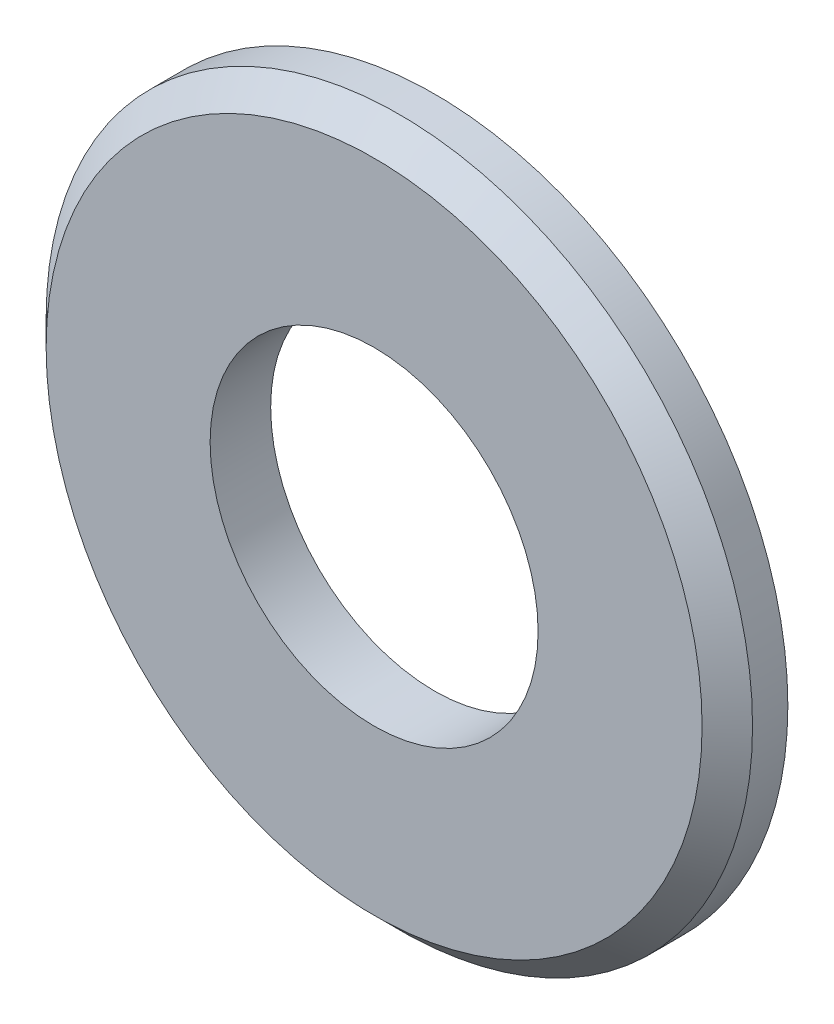
ISO-10303-21;
HEADER;
FILE_DESCRIPTION(('STEP AP214'),'2;1');
FILE_NAME('part.step','',(''),(''),'','','');
FILE_SCHEMA(('AUTOMOTIVE_DESIGN { 1 0 10303 214 1 1 1 1 }'));
ENDSEC;
DATA;
#1=APPLICATION_CONTEXT('core data for automotive mechanical design processes');
#2=APPLICATION_PROTOCOL_DEFINITION('international standard','automotive_design',2000,#1);
#3=PRODUCT_CONTEXT('',#1,'mechanical');
#4=PRODUCT('Part','Part','',(#3));
#5=PRODUCT_RELATED_PRODUCT_CATEGORY('part','',(#4));
#6=PRODUCT_DEFINITION_FORMATION('','',#4);
#7=PRODUCT_DEFINITION_CONTEXT('part definition',#1,'design');
#8=PRODUCT_DEFINITION('design','',#6,#7);
#9=PRODUCT_DEFINITION_SHAPE('','',#8);
#10=(LENGTH_UNIT() NAMED_UNIT(*) SI_UNIT(.MILLI.,.METRE.));
#11=(NAMED_UNIT(*) PLANE_ANGLE_UNIT() SI_UNIT($,.RADIAN.));
#12=(NAMED_UNIT(*) SI_UNIT($,.STERADIAN.) SOLID_ANGLE_UNIT());
#13=UNCERTAINTY_MEASURE_WITH_UNIT(LENGTH_MEASURE(1.E-05),#10,'distance_accuracy_value','');
#14=(GEOMETRIC_REPRESENTATION_CONTEXT(3) GLOBAL_UNCERTAINTY_ASSIGNED_CONTEXT((#13)) GLOBAL_UNIT_ASSIGNED_CONTEXT((#10,
#11,#12)) REPRESENTATION_CONTEXT('',''));
#15=CARTESIAN_POINT('',(0.,0.,0.));
#16=DIRECTION('',(0.,0.,1.));
#17=DIRECTION('',(1.,0.,0.));
#18=AXIS2_PLACEMENT_3D('',#15,#16,#17);
#19=CARTESIAN_POINT('',(0.,0.,1.2));
#20=DIRECTION('',(0.,0.,1.));
#21=DIRECTION('',(1.,0.,0.));
#22=AXIS2_PLACEMENT_3D('',#19,#20,#21);
#23=PLANE('',#22);
#24=CARTESIAN_POINT('',(0.,0.,1.2));
#25=DIRECTION('',(0.,0.,1.));
#26=DIRECTION('',(1.,0.,0.));
#27=AXIS2_PLACEMENT_3D('',#24,#25,#26);
#28=CIRCLE('',#27,6.49999999999999);
#29=CARTESIAN_POINT('',(6.49999999999999,0.,1.2));
#30=VERTEX_POINT('',#29);
#31=EDGE_CURVE('E38',#30,#30,#28,.T.);
#32=ORIENTED_EDGE('',*,*,#31,.T.);
#33=EDGE_LOOP('',(#32));
#34=FACE_BOUND('',#33,.T.);
#35=CARTESIAN_POINT('',(0.,0.,1.2));
#36=DIRECTION('',(0.,0.,1.));
#37=DIRECTION('',(1.,0.,0.));
#38=AXIS2_PLACEMENT_3D('',#35,#36,#37);
#39=CIRCLE('',#38,3.25);
#40=CARTESIAN_POINT('',(3.25,0.,1.2));
#41=VERTEX_POINT('',#40);
#42=EDGE_CURVE('E46',#41,#41,#39,.T.);
#43=ORIENTED_EDGE('',*,*,#42,.F.);
#44=EDGE_LOOP('',(#43));
#45=FACE_BOUND('',#44,.T.);
#46=ADVANCED_FACE('F31',(#34,#45),#23,.T.);
#47=CARTESIAN_POINT('',(0.,0.,0.));
#48=DIRECTION('',(0.,0.,1.));
#49=DIRECTION('',(1.,0.,0.));
#50=AXIS2_PLACEMENT_3D('',#47,#48,#49);
#51=PLANE('',#50);
#52=CARTESIAN_POINT('',(0.,0.,0.));
#53=DIRECTION('',(0.,0.,1.));
#54=DIRECTION('',(1.,0.,0.));
#55=AXIS2_PLACEMENT_3D('',#52,#53,#54);
#56=CIRCLE('',#55,7.);
#57=CARTESIAN_POINT('',(7.,0.,0.));
#58=VERTEX_POINT('',#57);
#59=EDGE_CURVE('E42',#58,#58,#56,.T.);
#60=ORIENTED_EDGE('',*,*,#59,.F.);
#61=EDGE_LOOP('',(#60));
#62=FACE_BOUND('',#61,.T.);
#63=CARTESIAN_POINT('',(0.,0.,0.));
#64=DIRECTION('',(0.,0.,1.));
#65=DIRECTION('',(1.,0.,0.));
#66=AXIS2_PLACEMENT_3D('',#63,#64,#65);
#67=CIRCLE('',#66,3.25);
#68=CARTESIAN_POINT('',(3.25,0.,0.));
#69=VERTEX_POINT('',#68);
#70=EDGE_CURVE('E51',#69,#69,#67,.T.);
#71=ORIENTED_EDGE('',*,*,#70,.T.);
#72=EDGE_LOOP('',(#71));
#73=FACE_BOUND('',#72,.T.);
#74=ADVANCED_FACE('F55',(#62,#73),#51,.F.);
#75=CARTESIAN_POINT('',(0.,0.,1.2));
#76=DIRECTION('',(0.,0.,-1.));
#77=DIRECTION('',(-1.,0.,0.));
#78=AXIS2_PLACEMENT_3D('',#75,#76,#77);
#79=CYLINDRICAL_SURFACE('',#78,7.);
#80=CARTESIAN_POINT('',(0.,0.,0.699999999999996));
#81=DIRECTION('',(0.,0.,1.));
#82=DIRECTION('',(1.,0.,0.));
#83=AXIS2_PLACEMENT_3D('',#80,#81,#82);
#84=CIRCLE('',#83,7.);
#85=CARTESIAN_POINT('',(7.,0.,0.699999999999996));
#86=VERTEX_POINT('',#85);
#87=EDGE_CURVE('E10',#86,#86,#84,.F.);
#88=ORIENTED_EDGE('',*,*,#87,.T.);
#89=EDGE_LOOP('',(#88));
#90=FACE_BOUND('',#89,.T.);
#91=ORIENTED_EDGE('',*,*,#59,.T.);
#92=EDGE_LOOP('',(#91));
#93=FACE_BOUND('',#92,.T.);
#94=ADVANCED_FACE('F33',(#90,#93),#79,.T.);
#95=CARTESIAN_POINT('',(0.,0.,1.2));
#96=DIRECTION('',(0.,0.,-1.));
#97=DIRECTION('',(-1.,0.,0.));
#98=AXIS2_PLACEMENT_3D('',#95,#96,#97);
#99=CYLINDRICAL_SURFACE('',#98,3.25);
#100=ORIENTED_EDGE('',*,*,#42,.T.);
#101=EDGE_LOOP('',(#100));
#102=FACE_BOUND('',#101,.T.);
#103=ORIENTED_EDGE('',*,*,#70,.F.);
#104=EDGE_LOOP('',(#103));
#105=FACE_BOUND('',#104,.T.);
#106=ADVANCED_FACE('F57',(#102,#105),#99,.F.);
#107=CARTESIAN_POINT('',(0.,0.,1.2));
#108=DIRECTION('',(0.,0.,-1.));
#109=DIRECTION('',(-1.,0.,0.));
#110=AXIS2_PLACEMENT_3D('',#107,#108,#109);
#111=CONICAL_SURFACE('',#110,6.49999999999999,0.785398163397454);
#112=ORIENTED_EDGE('',*,*,#87,.F.);
#113=EDGE_LOOP('',(#112));
#114=FACE_BOUND('',#113,.T.);
#115=ORIENTED_EDGE('',*,*,#31,.F.);
#116=EDGE_LOOP('',(#115));
#117=FACE_BOUND('',#116,.T.);
#118=ADVANCED_FACE('F59',(#114,#117),#111,.T.);
#119=CLOSED_SHELL('',(#46,#74,#94,#106,#118));
#120=MANIFOLD_SOLID_BREP('B2',#119);
#121=ADVANCED_BREP_SHAPE_REPRESENTATION('',(#18,#120),#14);
#122=SHAPE_DEFINITION_REPRESENTATION(#9,#121);
ENDSEC;
END-ISO-10303-21;
